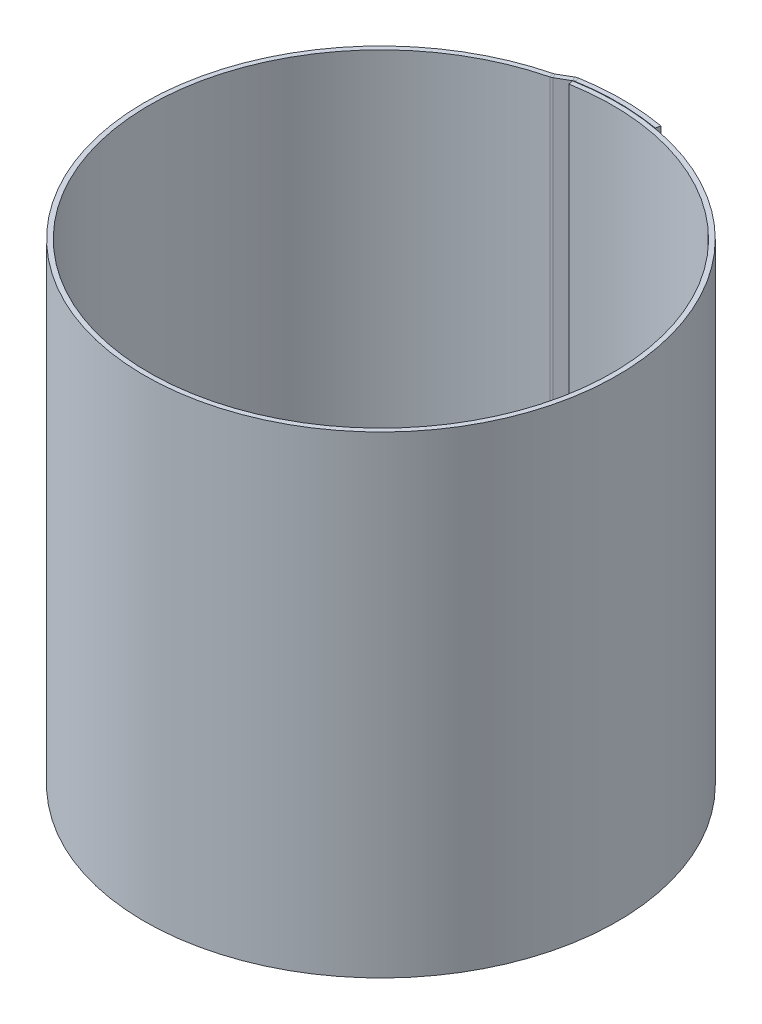
ISO-10303-21;
HEADER;
FILE_DESCRIPTION(('STEP AP214'),'2;1');
FILE_NAME('part.step','',(''),(''),'','','');
FILE_SCHEMA(('AUTOMOTIVE_DESIGN { 1 0 10303 214 1 1 1 1 }'));
ENDSEC;
DATA;
#1=APPLICATION_CONTEXT('core data for automotive mechanical design processes');
#2=APPLICATION_PROTOCOL_DEFINITION('international standard','automotive_design',2000,#1);
#3=PRODUCT_CONTEXT('',#1,'mechanical');
#4=PRODUCT('Part','Part','',(#3));
#5=PRODUCT_RELATED_PRODUCT_CATEGORY('part','',(#4));
#6=PRODUCT_DEFINITION_FORMATION('','',#4);
#7=PRODUCT_DEFINITION_CONTEXT('part definition',#1,'design');
#8=PRODUCT_DEFINITION('design','',#6,#7);
#9=PRODUCT_DEFINITION_SHAPE('','',#8);
#10=(LENGTH_UNIT() NAMED_UNIT(*) SI_UNIT(.MILLI.,.METRE.));
#11=(NAMED_UNIT(*) PLANE_ANGLE_UNIT() SI_UNIT($,.RADIAN.));
#12=(NAMED_UNIT(*) SI_UNIT($,.STERADIAN.) SOLID_ANGLE_UNIT());
#13=UNCERTAINTY_MEASURE_WITH_UNIT(LENGTH_MEASURE(1.E-05),#10,'distance_accuracy_value','');
#14=(GEOMETRIC_REPRESENTATION_CONTEXT(3) GLOBAL_UNCERTAINTY_ASSIGNED_CONTEXT((#13)) GLOBAL_UNIT_ASSIGNED_CONTEXT((#10,
#11,#12)) REPRESENTATION_CONTEXT('',''));
#15=CARTESIAN_POINT('',(0.,0.,0.));
#16=DIRECTION('',(0.,0.,1.));
#17=DIRECTION('',(1.,0.,0.));
#18=AXIS2_PLACEMENT_3D('',#15,#16,#17);
#19=CARTESIAN_POINT('',(-11.8167217945915,100.,-48.6243611802243));
#20=DIRECTION('',(0.,1.,0.));
#21=DIRECTION('',(0.,0.,1.));
#22=AXIS2_PLACEMENT_3D('',#19,#20,#21);
#23=PLANE('',#22);
#24=DIRECTION('',(0.500000000000007,0.,0.866025403784435));
#25=VECTOR('',#24,1.);
#26=CARTESIAN_POINT('',(-11.8167217945915,100.,-48.6243611802243));
#27=LINE('',#26,#25);
#28=CARTESIAN_POINT('',(-11.8167217945915,100.,-48.6243611802243));
#29=VERTEX_POINT('',#28);
#30=CARTESIAN_POINT('',(-11.3167217945914,100.,-47.7583357764399));
#31=VERTEX_POINT('',#30);
#32=EDGE_CURVE('E11',#29,#31,#27,.T.);
#33=ORIENTED_EDGE('',*,*,#32,.F.);
#34=CARTESIAN_POINT('',(-12.3167217945915,100.,-49.4903865840088));
#35=DIRECTION('',(0.,1.,0.));
#36=DIRECTION('',(0.,0.,1.));
#37=AXIS2_PLACEMENT_3D('',#34,#35,#36);
#38=CIRCLE('',#37,1.);
#39=CARTESIAN_POINT('',(-12.0752174456779,100.,-48.5199868470674));
#40=VERTEX_POINT('',#39);
#41=EDGE_CURVE('E179',#29,#40,#38,.F.);
#42=ORIENTED_EDGE('',*,*,#41,.T.);
#43=DIRECTION('',(-0.241504348913555,0.,-0.970399736941349));
#44=VECTOR('',#43,1.);
#45=CARTESIAN_POINT('',(-11.8337130967643,100.,-47.5495871101261));
#46=LINE('',#45,#44);
#47=CARTESIAN_POINT('',(-11.8337130967643,100.,-47.5495871101261));
#48=VERTEX_POINT('',#47);
#49=EDGE_CURVE('E54',#48,#40,#46,.T.);
#50=ORIENTED_EDGE('',*,*,#49,.F.);
#51=CARTESIAN_POINT('',(-12.3167217945915,100.,-49.4903865840088));
#52=DIRECTION('',(0.,1.,0.));
#53=DIRECTION('',(1.,0.,0.));
#54=AXIS2_PLACEMENT_3D('',#51,#52,#53);
#55=CIRCLE('',#54,2.);
#56=EDGE_CURVE('E255',#31,#48,#55,.F.);
#57=ORIENTED_EDGE('',*,*,#56,.F.);
#58=EDGE_LOOP('',(#33,#42,#50,#57));
#59=FACE_BOUND('',#58,.T.);
#60=ADVANCED_FACE('F46',(#59),#23,.T.);
#61=CARTESIAN_POINT('',(-11.8337130967643,100.,-47.5495871101261));
#62=DIRECTION('',(0.,1.,0.));
#63=DIRECTION('',(0.,0.,1.));
#64=AXIS2_PLACEMENT_3D('',#61,#62,#63);
#65=PLANE('',#64);
#66=DIRECTION('',(-0.866025403784435,0.,0.500000000000007));
#67=VECTOR('',#66,1.);
#68=CARTESIAN_POINT('',(-8.87342187878016,100.,-50.3236761789238));
#69=LINE('',#68,#67);
#70=CARTESIAN_POINT('',(-9.18197419534722,100.,-50.1455334158947));
#71=VERTEX_POINT('',#70);
#72=EDGE_CURVE('E146',#71,#29,#69,.T.);
#73=ORIENTED_EDGE('',*,*,#72,.T.);
#74=ORIENTED_EDGE('',*,*,#32,.T.);
#75=DIRECTION('',(-0.866025403784435,0.,0.500000000000007));
#76=VECTOR('',#75,1.);
#77=CARTESIAN_POINT('',(-8.37342187878015,100.,-49.4576507751394));
#78=LINE('',#77,#76);
#79=CARTESIAN_POINT('',(-8.68197419534721,100.,-49.2795080121103));
#80=VERTEX_POINT('',#79);
#81=EDGE_CURVE('E149',#80,#31,#78,.T.);
#82=ORIENTED_EDGE('',*,*,#81,.F.);
#83=DIRECTION('',(-0.500000000000007,0.,-0.866025403784435));
#84=VECTOR('',#83,1.);
#85=CARTESIAN_POINT('',(-8.68197419534721,100.,-49.2795080121103));
#86=LINE('',#85,#84);
#87=EDGE_CURVE('E142',#80,#71,#86,.T.);
#88=ORIENTED_EDGE('',*,*,#87,.T.);
#89=EDGE_LOOP('',(#73,#74,#82,#88));
#90=FACE_BOUND('',#89,.T.);
#91=ADVANCED_FACE('F144',(#90),#65,.T.);
#92=CARTESIAN_POINT('',(-12.0752174456779,0.,-48.5199868470674));
#93=DIRECTION('',(0.,-1.,0.));
#94=DIRECTION('',(0.,0.,-1.));
#95=AXIS2_PLACEMENT_3D('',#92,#93,#94);
#96=PLANE('',#95);
#97=DIRECTION('',(0.241504348913555,0.,0.970399736941349));
#98=VECTOR('',#97,1.);
#99=CARTESIAN_POINT('',(-12.0752174456779,0.,-48.5199868470674));
#100=LINE('',#99,#98);
#101=CARTESIAN_POINT('',(-12.0752174456779,0.,-48.5199868470674));
#102=VERTEX_POINT('',#101);
#103=CARTESIAN_POINT('',(-11.8337130967643,0.,-47.5495871101261));
#104=VERTEX_POINT('',#103);
#105=EDGE_CURVE('E109',#102,#104,#100,.T.);
#106=ORIENTED_EDGE('',*,*,#105,.F.);
#107=CARTESIAN_POINT('',(-12.3167217945915,0.,-49.4903865840088));
#108=DIRECTION('',(0.,1.,0.));
#109=DIRECTION('',(0.,0.,1.));
#110=AXIS2_PLACEMENT_3D('',#107,#108,#109);
#111=CIRCLE('',#110,1.);
#112=CARTESIAN_POINT('',(-11.8167217945915,0.,-48.6243611802243));
#113=VERTEX_POINT('',#112);
#114=EDGE_CURVE('E213',#113,#102,#111,.F.);
#115=ORIENTED_EDGE('',*,*,#114,.F.);
#116=DIRECTION('',(-0.500000000000007,0.,-0.866025403784435));
#117=VECTOR('',#116,1.);
#118=CARTESIAN_POINT('',(-11.3167217945914,0.,-47.7583357764399));
#119=LINE('',#118,#117);
#120=CARTESIAN_POINT('',(-11.3167217945914,0.,-47.7583357764399));
#121=VERTEX_POINT('',#120);
#122=EDGE_CURVE('E102',#121,#113,#119,.T.);
#123=ORIENTED_EDGE('',*,*,#122,.F.);
#124=CARTESIAN_POINT('',(-12.3167217945915,0.,-49.4903865840088));
#125=DIRECTION('',(0.,1.,0.));
#126=DIRECTION('',(1.,0.,0.));
#127=AXIS2_PLACEMENT_3D('',#124,#125,#126);
#128=CIRCLE('',#127,2.);
#129=EDGE_CURVE('E194',#121,#104,#128,.F.);
#130=ORIENTED_EDGE('',*,*,#129,.T.);
#131=EDGE_LOOP('',(#106,#115,#123,#130));
#132=FACE_BOUND('',#131,.T.);
#133=ADVANCED_FACE('F260',(#132),#96,.T.);
#134=CARTESIAN_POINT('',(-11.3167217945914,0.,-47.7583357764399));
#135=DIRECTION('',(0.,-1.,0.));
#136=DIRECTION('',(0.,0.,-1.));
#137=AXIS2_PLACEMENT_3D('',#134,#135,#136);
#138=PLANE('',#137);
#139=CARTESIAN_POINT('',(0.,0.,0.));
#140=DIRECTION('',(0.,1.,0.));
#141=DIRECTION('',(0.,0.,1.));
#142=AXIS2_PLACEMENT_3D('',#139,#140,#141);
#143=CIRCLE('',#142,50.);
#144=CARTESIAN_POINT('',(-8.6824088833465,0.,-49.2403876506104));
#145=VERTEX_POINT('',#144);
#146=EDGE_CURVE('E185',#102,#145,#143,.T.);
#147=ORIENTED_EDGE('',*,*,#146,.F.);
#148=ORIENTED_EDGE('',*,*,#105,.T.);
#149=CARTESIAN_POINT('',(0.,0.,0.));
#150=DIRECTION('',(0.,1.,0.));
#151=DIRECTION('',(1.,0.,0.));
#152=AXIS2_PLACEMENT_3D('',#149,#150,#151);
#153=CIRCLE('',#152,49.);
#154=CARTESIAN_POINT('',(-8.50876070567957,0.,-48.2555798975982));
#155=VERTEX_POINT('',#154);
#156=EDGE_CURVE('E191',#104,#155,#153,.T.);
#157=ORIENTED_EDGE('',*,*,#156,.T.);
#158=DIRECTION('',(-0.173648177666926,0.,-0.984807753012209));
#159=VECTOR('',#158,1.);
#160=CARTESIAN_POINT('',(-8.50876070567957,0.,-48.2555798975982));
#161=LINE('',#160,#159);
#162=EDGE_CURVE('E188',#155,#145,#161,.T.);
#163=ORIENTED_EDGE('',*,*,#162,.T.);
#164=EDGE_LOOP('',(#147,#148,#157,#163));
#165=FACE_BOUND('',#164,.T.);
#166=ADVANCED_FACE('F246',(#165),#138,.T.);
#167=CARTESIAN_POINT('',(-8.51525216664444,100.,-50.3855185597852));
#168=DIRECTION('',(0.,1.,0.));
#169=DIRECTION('',(0.,0.,1.));
#170=AXIS2_PLACEMENT_3D('',#167,#168,#169);
#171=PLANE('',#170);
#172=DIRECTION('',(0.16663898564862,0.,0.986017975729651));
#173=VECTOR('',#172,1.);
#174=CARTESIAN_POINT('',(-8.51525216664444,100.,-50.3855185597852));
#175=LINE('',#174,#173);
#176=CARTESIAN_POINT('',(-8.51525216664444,100.,-50.3855185597852));
#177=VERTEX_POINT('',#176);
#178=CARTESIAN_POINT('',(-8.34861318099582,100.,-49.3995005840555));
#179=VERTEX_POINT('',#178);
#180=EDGE_CURVE('E154',#177,#179,#175,.T.);
#181=ORIENTED_EDGE('',*,*,#180,.F.);
#182=CARTESIAN_POINT('',(-8.1819741953472,100.,-48.4134826083259));
#183=DIRECTION('',(0.,1.,0.));
#184=DIRECTION('',(0.,0.,1.));
#185=AXIS2_PLACEMENT_3D('',#182,#183,#184);
#186=CIRCLE('',#185,2.);
#187=EDGE_CURVE('E158',#177,#71,#186,.T.);
#188=ORIENTED_EDGE('',*,*,#187,.T.);
#189=ORIENTED_EDGE('',*,*,#87,.F.);
#190=CARTESIAN_POINT('',(-8.1819741953472,100.,-48.4134826083259));
#191=DIRECTION('',(0.,1.,0.));
#192=DIRECTION('',(1.,0.,0.));
#193=AXIS2_PLACEMENT_3D('',#190,#191,#192);
#194=CIRCLE('',#193,1.);
#195=EDGE_CURVE('E267',#179,#80,#194,.T.);
#196=ORIENTED_EDGE('',*,*,#195,.F.);
#197=EDGE_LOOP('',(#181,#188,#189,#196));
#198=FACE_BOUND('',#197,.T.);
#199=ADVANCED_FACE('F160',(#198),#171,.T.);
#200=CARTESIAN_POINT('',(-8.68197419534721,100.,-49.2795080121103));
#201=DIRECTION('',(0.,1.,0.));
#202=DIRECTION('',(0.,0.,1.));
#203=AXIS2_PLACEMENT_3D('',#200,#201,#202);
#204=PLANE('',#203);
#205=CARTESIAN_POINT('',(0.,100.,0.));
#206=DIRECTION('',(0.,1.,0.));
#207=DIRECTION('',(0.,0.,1.));
#208=AXIS2_PLACEMENT_3D('',#205,#206,#207);
#209=CIRCLE('',#208,51.1);
#210=CARTESIAN_POINT('',(8.87342187878016,100.,-50.3236761789238));
#211=VERTEX_POINT('',#210);
#212=EDGE_CURVE('E164',#211,#177,#209,.T.);
#213=ORIENTED_EDGE('',*,*,#212,.T.);
#214=ORIENTED_EDGE('',*,*,#180,.T.);
#215=CARTESIAN_POINT('',(0.,100.,0.));
#216=DIRECTION('',(0.,1.,0.));
#217=DIRECTION('',(1.,0.,0.));
#218=AXIS2_PLACEMENT_3D('',#215,#216,#217);
#219=CIRCLE('',#218,50.1);
#220=CARTESIAN_POINT('',(8.69977370111322,100.,-49.3388684259116));
#221=VERTEX_POINT('',#220);
#222=EDGE_CURVE('E274',#221,#179,#219,.T.);
#223=ORIENTED_EDGE('',*,*,#222,.F.);
#224=DIRECTION('',(-0.173648177666934,0.,0.984807753012207));
#225=VECTOR('',#224,1.);
#226=CARTESIAN_POINT('',(8.87342187878016,100.,-50.3236761789238));
#227=LINE('',#226,#225);
#228=EDGE_CURVE('E277',#211,#221,#227,.T.);
#229=ORIENTED_EDGE('',*,*,#228,.F.);
#230=EDGE_LOOP('',(#213,#214,#223,#229));
#231=FACE_BOUND('',#230,.T.);
#232=ADVANCED_FACE('F283',(#231),#204,.T.);
#233=CARTESIAN_POINT('',(-9.18197419534722,0.,-50.1455334158947));
#234=DIRECTION('',(0.,-1.,0.));
#235=DIRECTION('',(0.,0.,-1.));
#236=AXIS2_PLACEMENT_3D('',#233,#234,#235);
#237=PLANE('',#236);
#238=DIRECTION('',(0.500000000000007,0.,0.866025403784435));
#239=VECTOR('',#238,1.);
#240=CARTESIAN_POINT('',(-9.18197419534722,0.,-50.1455334158947));
#241=LINE('',#240,#239);
#242=CARTESIAN_POINT('',(-9.18197419534722,0.,-50.1455334158947));
#243=VERTEX_POINT('',#242);
#244=CARTESIAN_POINT('',(-8.68197419534721,0.,-49.2795080121103));
#245=VERTEX_POINT('',#244);
#246=EDGE_CURVE('E155',#243,#245,#241,.T.);
#247=ORIENTED_EDGE('',*,*,#246,.F.);
#248=CARTESIAN_POINT('',(-8.1819741953472,0.,-48.4134826083259));
#249=DIRECTION('',(0.,1.,0.));
#250=DIRECTION('',(0.,0.,1.));
#251=AXIS2_PLACEMENT_3D('',#248,#249,#250);
#252=CIRCLE('',#251,2.);
#253=CARTESIAN_POINT('',(-8.51525216664444,0.,-50.3855185597852));
#254=VERTEX_POINT('',#253);
#255=EDGE_CURVE('E171',#254,#243,#252,.T.);
#256=ORIENTED_EDGE('',*,*,#255,.F.);
#257=DIRECTION('',(-0.16663898564862,0.,-0.986017975729651));
#258=VECTOR('',#257,1.);
#259=CARTESIAN_POINT('',(-8.34861318099582,0.,-49.3995005840555));
#260=LINE('',#259,#258);
#261=CARTESIAN_POINT('',(-8.34861318099582,0.,-49.3995005840555));
#262=VERTEX_POINT('',#261);
#263=EDGE_CURVE('E239',#262,#254,#260,.T.);
#264=ORIENTED_EDGE('',*,*,#263,.F.);
#265=CARTESIAN_POINT('',(-8.1819741953472,0.,-48.4134826083259));
#266=DIRECTION('',(0.,1.,0.));
#267=DIRECTION('',(1.,0.,0.));
#268=AXIS2_PLACEMENT_3D('',#265,#266,#267);
#269=CIRCLE('',#268,1.);
#270=EDGE_CURVE('E198',#262,#245,#269,.T.);
#271=ORIENTED_EDGE('',*,*,#270,.T.);
#272=EDGE_LOOP('',(#247,#256,#264,#271));
#273=FACE_BOUND('',#272,.T.);
#274=ADVANCED_FACE('F290',(#273),#237,.T.);
#275=CARTESIAN_POINT('',(-8.34861318099582,0.,-49.3995005840555));
#276=DIRECTION('',(0.,-1.,0.));
#277=DIRECTION('',(0.,0.,-1.));
#278=AXIS2_PLACEMENT_3D('',#275,#276,#277);
#279=PLANE('',#278);
#280=DIRECTION('',(-0.866025403784435,0.,0.500000000000007));
#281=VECTOR('',#280,1.);
#282=CARTESIAN_POINT('',(-8.87342187878016,0.,-50.3236761789238));
#283=LINE('',#282,#281);
#284=EDGE_CURVE('E211',#243,#113,#283,.T.);
#285=ORIENTED_EDGE('',*,*,#284,.F.);
#286=ORIENTED_EDGE('',*,*,#246,.T.);
#287=DIRECTION('',(-0.866025403784435,0.,0.500000000000007));
#288=VECTOR('',#287,1.);
#289=CARTESIAN_POINT('',(-8.37342187878015,0.,-49.4576507751394));
#290=LINE('',#289,#288);
#291=EDGE_CURVE('E196',#245,#121,#290,.T.);
#292=ORIENTED_EDGE('',*,*,#291,.T.);
#293=ORIENTED_EDGE('',*,*,#122,.T.);
#294=EDGE_LOOP('',(#285,#286,#292,#293));
#295=FACE_BOUND('',#294,.T.);
#296=ADVANCED_FACE('F292',(#295),#279,.T.);
#297=CARTESIAN_POINT('',(0.,100.,0.));
#298=DIRECTION('',(0.,-1.,0.));
#299=DIRECTION('',(0.,0.,-1.));
#300=AXIS2_PLACEMENT_3D('',#297,#298,#299);
#301=CYLINDRICAL_SURFACE('',#300,50.);
#302=ORIENTED_EDGE('',*,*,#146,.T.);
#303=DIRECTION('',(0.,-1.,0.));
#304=VECTOR('',#303,1.);
#305=CARTESIAN_POINT('',(-8.6824088833465,100.,-49.2403876506104));
#306=LINE('',#305,#304);
#307=CARTESIAN_POINT('',(-8.6824088833465,100.,-49.2403876506104));
#308=VERTEX_POINT('',#307);
#309=EDGE_CURVE('E237',#308,#145,#306,.T.);
#310=ORIENTED_EDGE('',*,*,#309,.F.);
#311=CARTESIAN_POINT('',(0.,100.,0.));
#312=DIRECTION('',(0.,1.,0.));
#313=DIRECTION('',(0.,0.,1.));
#314=AXIS2_PLACEMENT_3D('',#311,#312,#313);
#315=CIRCLE('',#314,50.);
#316=EDGE_CURVE('E115',#40,#308,#315,.T.);
#317=ORIENTED_EDGE('',*,*,#316,.F.);
#318=DIRECTION('',(0.,-1.,0.));
#319=VECTOR('',#318,1.);
#320=CARTESIAN_POINT('',(-12.0752174456779,100.,-48.5199868470674));
#321=LINE('',#320,#319);
#322=EDGE_CURVE('E181',#40,#102,#321,.T.);
#323=ORIENTED_EDGE('',*,*,#322,.T.);
#324=EDGE_LOOP('',(#302,#310,#317,#323));
#325=FACE_BOUND('',#324,.T.);
#326=ADVANCED_FACE('F331',(#325),#301,.T.);
#327=CARTESIAN_POINT('',(-8.50876070567957,100.,-48.2555798975982));
#328=DIRECTION('',(-0.984807753012209,0.,0.173648177666926));
#329=DIRECTION('',(0.173648177666926,0.,0.984807753012209));
#330=AXIS2_PLACEMENT_3D('',#327,#328,#329);
#331=PLANE('',#330);
#332=ORIENTED_EDGE('',*,*,#162,.F.);
#333=DIRECTION('',(0.,-1.,0.));
#334=VECTOR('',#333,1.);
#335=CARTESIAN_POINT('',(-8.50876070567957,100.,-48.2555798975982));
#336=LINE('',#335,#334);
#337=CARTESIAN_POINT('',(-8.50876070567957,100.,-48.2555798975982));
#338=VERTEX_POINT('',#337);
#339=EDGE_CURVE('E235',#338,#155,#336,.T.);
#340=ORIENTED_EDGE('',*,*,#339,.F.);
#341=DIRECTION('',(-0.173648177666926,0.,-0.984807753012209));
#342=VECTOR('',#341,1.);
#343=CARTESIAN_POINT('',(-8.50876070567957,100.,-48.2555798975982));
#344=LINE('',#343,#342);
#345=EDGE_CURVE('E269',#338,#308,#344,.T.);
#346=ORIENTED_EDGE('',*,*,#345,.T.);
#347=ORIENTED_EDGE('',*,*,#309,.T.);
#348=EDGE_LOOP('',(#332,#340,#346,#347));
#349=FACE_BOUND('',#348,.T.);
#350=ADVANCED_FACE('F334',(#349),#331,.T.);
#351=CARTESIAN_POINT('',(0.,100.,0.));
#352=DIRECTION('',(0.,-1.,0.));
#353=DIRECTION('',(0.,0.,-1.));
#354=AXIS2_PLACEMENT_3D('',#351,#352,#353);
#355=CYLINDRICAL_SURFACE('',#354,49.);
#356=ORIENTED_EDGE('',*,*,#156,.F.);
#357=DIRECTION('',(0.,-1.,0.));
#358=VECTOR('',#357,1.);
#359=CARTESIAN_POINT('',(-11.8337130967643,100.,-47.5495871101261));
#360=LINE('',#359,#358);
#361=EDGE_CURVE('E232',#48,#104,#360,.T.);
#362=ORIENTED_EDGE('',*,*,#361,.F.);
#363=CARTESIAN_POINT('',(0.,100.,0.));
#364=DIRECTION('',(0.,1.,0.));
#365=DIRECTION('',(1.,0.,0.));
#366=AXIS2_PLACEMENT_3D('',#363,#364,#365);
#367=CIRCLE('',#366,49.);
#368=EDGE_CURVE('E265',#48,#338,#367,.T.);
#369=ORIENTED_EDGE('',*,*,#368,.T.);
#370=ORIENTED_EDGE('',*,*,#339,.T.);
#371=EDGE_LOOP('',(#356,#362,#369,#370));
#372=FACE_BOUND('',#371,.T.);
#373=ADVANCED_FACE('F258',(#372),#355,.F.);
#374=CARTESIAN_POINT('',(-12.3167217945915,100.,-49.4903865840088));
#375=DIRECTION('',(0.,-1.,0.));
#376=DIRECTION('',(0.,0.,-1.));
#377=AXIS2_PLACEMENT_3D('',#374,#375,#376);
#378=CYLINDRICAL_SURFACE('',#377,2.);
#379=ORIENTED_EDGE('',*,*,#129,.F.);
#380=DIRECTION('',(0.,-1.,0.));
#381=VECTOR('',#380,1.);
#382=CARTESIAN_POINT('',(-11.3167217945914,100.,-47.7583357764399));
#383=LINE('',#382,#381);
#384=EDGE_CURVE('E229',#31,#121,#383,.T.);
#385=ORIENTED_EDGE('',*,*,#384,.F.);
#386=ORIENTED_EDGE('',*,*,#56,.T.);
#387=ORIENTED_EDGE('',*,*,#361,.T.);
#388=EDGE_LOOP('',(#379,#385,#386,#387));
#389=FACE_BOUND('',#388,.T.);
#390=ADVANCED_FACE('F252',(#389),#378,.T.);
#391=CARTESIAN_POINT('',(-8.37342187878015,100.,-49.4576507751394));
#392=DIRECTION('',(0.500000000000007,0.,0.866025403784435));
#393=DIRECTION('',(0.866025403784435,0.,-0.500000000000007));
#394=AXIS2_PLACEMENT_3D('',#391,#392,#393);
#395=PLANE('',#394);
#396=ORIENTED_EDGE('',*,*,#291,.F.);
#397=DIRECTION('',(0.,-1.,0.));
#398=VECTOR('',#397,1.);
#399=CARTESIAN_POINT('',(-8.68197419534721,100.,-49.2795080121103));
#400=LINE('',#399,#398);
#401=EDGE_CURVE('E226',#80,#245,#400,.T.);
#402=ORIENTED_EDGE('',*,*,#401,.F.);
#403=ORIENTED_EDGE('',*,*,#81,.T.);
#404=ORIENTED_EDGE('',*,*,#384,.T.);
#405=EDGE_LOOP('',(#396,#402,#403,#404));
#406=FACE_BOUND('',#405,.T.);
#407=ADVANCED_FACE('F263',(#406),#395,.T.);
#408=CARTESIAN_POINT('',(-8.1819741953472,100.,-48.4134826083259));
#409=DIRECTION('',(0.,-1.,0.));
#410=DIRECTION('',(0.,0.,-1.));
#411=AXIS2_PLACEMENT_3D('',#408,#409,#410);
#412=CYLINDRICAL_SURFACE('',#411,1.);
#413=ORIENTED_EDGE('',*,*,#270,.F.);
#414=DIRECTION('',(0.,-1.,0.));
#415=VECTOR('',#414,1.);
#416=CARTESIAN_POINT('',(-8.34861318099582,100.,-49.3995005840555));
#417=LINE('',#416,#415);
#418=EDGE_CURVE('E223',#179,#262,#417,.T.);
#419=ORIENTED_EDGE('',*,*,#418,.F.);
#420=ORIENTED_EDGE('',*,*,#195,.T.);
#421=ORIENTED_EDGE('',*,*,#401,.T.);
#422=EDGE_LOOP('',(#413,#419,#420,#421));
#423=FACE_BOUND('',#422,.T.);
#424=ADVANCED_FACE('F294',(#423),#412,.F.);
#425=CARTESIAN_POINT('',(0.,100.,0.));
#426=DIRECTION('',(0.,-1.,0.));
#427=DIRECTION('',(0.,0.,-1.));
#428=AXIS2_PLACEMENT_3D('',#425,#426,#427);
#429=CYLINDRICAL_SURFACE('',#428,50.1);
#430=CARTESIAN_POINT('',(0.,0.,0.));
#431=DIRECTION('',(0.,1.,0.));
#432=DIRECTION('',(1.,0.,0.));
#433=AXIS2_PLACEMENT_3D('',#430,#431,#432);
#434=CIRCLE('',#433,50.1);
#435=CARTESIAN_POINT('',(8.69977370111322,0.,-49.3388684259116));
#436=VERTEX_POINT('',#435);
#437=EDGE_CURVE('E201',#436,#262,#434,.T.);
#438=ORIENTED_EDGE('',*,*,#437,.F.);
#439=DIRECTION('',(0.,-1.,0.));
#440=VECTOR('',#439,1.);
#441=CARTESIAN_POINT('',(8.69977370111322,100.,-49.3388684259116));
#442=LINE('',#441,#440);
#443=EDGE_CURVE('E221',#221,#436,#442,.T.);
#444=ORIENTED_EDGE('',*,*,#443,.F.);
#445=ORIENTED_EDGE('',*,*,#222,.T.);
#446=ORIENTED_EDGE('',*,*,#418,.T.);
#447=EDGE_LOOP('',(#438,#444,#445,#446));
#448=FACE_BOUND('',#447,.T.);
#449=ADVANCED_FACE('F297',(#448),#429,.F.);
#450=CARTESIAN_POINT('',(8.87342187878016,100.,-50.3236761789238));
#451=DIRECTION('',(0.984807753012207,0.,0.173648177666934));
#452=DIRECTION('',(0.173648177666934,0.,-0.984807753012207));
#453=AXIS2_PLACEMENT_3D('',#450,#451,#452);
#454=PLANE('',#453);
#455=DIRECTION('',(-0.173648177666934,0.,0.984807753012207));
#456=VECTOR('',#455,1.);
#457=CARTESIAN_POINT('',(8.87342187878016,0.,-50.3236761789238));
#458=LINE('',#457,#456);
#459=CARTESIAN_POINT('',(8.87342187878016,0.,-50.3236761789238));
#460=VERTEX_POINT('',#459);
#461=EDGE_CURVE('E204',#460,#436,#458,.T.);
#462=ORIENTED_EDGE('',*,*,#461,.F.);
#463=DIRECTION('',(0.,-1.,0.));
#464=VECTOR('',#463,1.);
#465=CARTESIAN_POINT('',(8.87342187878016,100.,-50.3236761789238));
#466=LINE('',#465,#464);
#467=EDGE_CURVE('E219',#211,#460,#466,.T.);
#468=ORIENTED_EDGE('',*,*,#467,.F.);
#469=ORIENTED_EDGE('',*,*,#228,.T.);
#470=ORIENTED_EDGE('',*,*,#443,.T.);
#471=EDGE_LOOP('',(#462,#468,#469,#470));
#472=FACE_BOUND('',#471,.T.);
#473=ADVANCED_FACE('F300',(#472),#454,.T.);
#474=CARTESIAN_POINT('',(0.,100.,0.));
#475=DIRECTION('',(0.,-1.,0.));
#476=DIRECTION('',(0.,0.,-1.));
#477=AXIS2_PLACEMENT_3D('',#474,#475,#476);
#478=CYLINDRICAL_SURFACE('',#477,51.1);
#479=CARTESIAN_POINT('',(0.,0.,0.));
#480=DIRECTION('',(0.,1.,0.));
#481=DIRECTION('',(0.,0.,1.));
#482=AXIS2_PLACEMENT_3D('',#479,#480,#481);
#483=CIRCLE('',#482,51.1);
#484=EDGE_CURVE('E207',#460,#254,#483,.T.);
#485=ORIENTED_EDGE('',*,*,#484,.T.);
#486=DIRECTION('',(0.,-1.,0.));
#487=VECTOR('',#486,1.);
#488=CARTESIAN_POINT('',(-8.51525216664444,100.,-50.3855185597852));
#489=LINE('',#488,#487);
#490=EDGE_CURVE('E173',#177,#254,#489,.T.);
#491=ORIENTED_EDGE('',*,*,#490,.F.);
#492=ORIENTED_EDGE('',*,*,#212,.F.);
#493=ORIENTED_EDGE('',*,*,#467,.T.);
#494=EDGE_LOOP('',(#485,#491,#492,#493));
#495=FACE_BOUND('',#494,.T.);
#496=ADVANCED_FACE('F287',(#495),#478,.T.);
#497=CARTESIAN_POINT('',(-8.1819741953472,100.,-48.4134826083259));
#498=DIRECTION('',(0.,-1.,0.));
#499=DIRECTION('',(0.,0.,-1.));
#500=AXIS2_PLACEMENT_3D('',#497,#498,#499);
#501=CYLINDRICAL_SURFACE('',#500,2.);
#502=ORIENTED_EDGE('',*,*,#255,.T.);
#503=DIRECTION('',(0.,-1.,0.));
#504=VECTOR('',#503,1.);
#505=CARTESIAN_POINT('',(-9.18197419534722,100.,-50.1455334158947));
#506=LINE('',#505,#504);
#507=EDGE_CURVE('E168',#71,#243,#506,.T.);
#508=ORIENTED_EDGE('',*,*,#507,.F.);
#509=ORIENTED_EDGE('',*,*,#187,.F.);
#510=ORIENTED_EDGE('',*,*,#490,.T.);
#511=EDGE_LOOP('',(#502,#508,#509,#510));
#512=FACE_BOUND('',#511,.T.);
#513=ADVANCED_FACE('F169',(#512),#501,.T.);
#514=CARTESIAN_POINT('',(-8.87342187878016,100.,-50.3236761789238));
#515=DIRECTION('',(0.500000000000007,0.,0.866025403784435));
#516=DIRECTION('',(0.866025403784435,0.,-0.500000000000007));
#517=AXIS2_PLACEMENT_3D('',#514,#515,#516);
#518=PLANE('',#517);
#519=ORIENTED_EDGE('',*,*,#284,.T.);
#520=DIRECTION('',(0.,-1.,0.));
#521=VECTOR('',#520,1.);
#522=CARTESIAN_POINT('',(-11.8167217945915,100.,-48.6243611802243));
#523=LINE('',#522,#521);
#524=EDGE_CURVE('E174',#29,#113,#523,.T.);
#525=ORIENTED_EDGE('',*,*,#524,.F.);
#526=ORIENTED_EDGE('',*,*,#72,.F.);
#527=ORIENTED_EDGE('',*,*,#507,.T.);
#528=EDGE_LOOP('',(#519,#525,#526,#527));
#529=FACE_BOUND('',#528,.T.);
#530=ADVANCED_FACE('F176',(#529),#518,.F.);
#531=CARTESIAN_POINT('',(-12.3167217945915,100.,-49.4903865840088));
#532=DIRECTION('',(0.,-1.,0.));
#533=DIRECTION('',(0.,0.,-1.));
#534=AXIS2_PLACEMENT_3D('',#531,#532,#533);
#535=CYLINDRICAL_SURFACE('',#534,1.);
#536=ORIENTED_EDGE('',*,*,#114,.T.);
#537=ORIENTED_EDGE('',*,*,#322,.F.);
#538=ORIENTED_EDGE('',*,*,#41,.F.);
#539=ORIENTED_EDGE('',*,*,#524,.T.);
#540=EDGE_LOOP('',(#536,#537,#538,#539));
#541=FACE_BOUND('',#540,.T.);
#542=ADVANCED_FACE('F309',(#541),#535,.F.);
#543=CARTESIAN_POINT('',(0.,100.,0.));
#544=DIRECTION('',(0.,1.,0.));
#545=DIRECTION('',(1.,0.,0.));
#546=AXIS2_PLACEMENT_3D('',#543,#544,#545);
#547=PLANE('',#546);
#548=ORIENTED_EDGE('',*,*,#316,.T.);
#549=ORIENTED_EDGE('',*,*,#345,.F.);
#550=ORIENTED_EDGE('',*,*,#368,.F.);
#551=ORIENTED_EDGE('',*,*,#49,.T.);
#552=EDGE_LOOP('',(#548,#549,#550,#551));
#553=FACE_BOUND('',#552,.T.);
#554=ADVANCED_FACE('F304',(#553),#547,.T.);
#555=CARTESIAN_POINT('',(0.,0.,0.));
#556=DIRECTION('',(0.,1.,0.));
#557=DIRECTION('',(1.,0.,0.));
#558=AXIS2_PLACEMENT_3D('',#555,#556,#557);
#559=PLANE('',#558);
#560=ORIENTED_EDGE('',*,*,#437,.T.);
#561=ORIENTED_EDGE('',*,*,#263,.T.);
#562=ORIENTED_EDGE('',*,*,#484,.F.);
#563=ORIENTED_EDGE('',*,*,#461,.T.);
#564=EDGE_LOOP('',(#560,#561,#562,#563));
#565=FACE_BOUND('',#564,.T.);
#566=ADVANCED_FACE('F302',(#565),#559,.F.);
#567=CLOSED_SHELL('',(#60,#91,#133,#166,#199,#232,#274,#296,#326,#350,#373,#390,#407,#424,#449,
#473,#496,#513,#530,#542,#554,#566));
#568=MANIFOLD_SOLID_BREP('B2',#567);
#569=ADVANCED_BREP_SHAPE_REPRESENTATION('',(#18,#568),#14);
#570=SHAPE_DEFINITION_REPRESENTATION(#9,#569);
ENDSEC;
END-ISO-10303-21;
